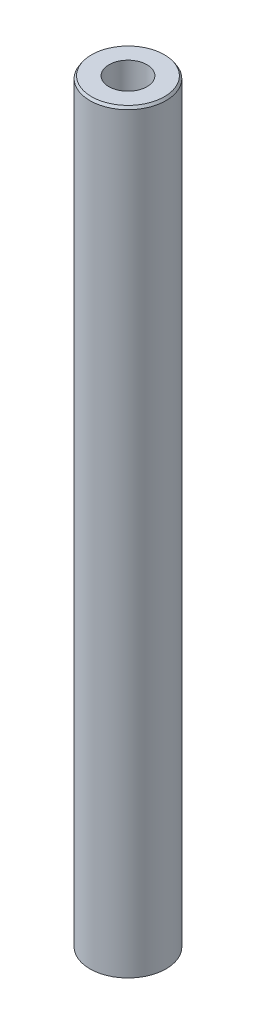
ISO-10303-21;
HEADER;
FILE_DESCRIPTION(('STEP AP214'),'2;1');
FILE_NAME('part.step','',(''),(''),'','','');
FILE_SCHEMA(('AUTOMOTIVE_DESIGN { 1 0 10303 214 1 1 1 1 }'));
ENDSEC;
DATA;
#1=APPLICATION_CONTEXT('core data for automotive mechanical design processes');
#2=APPLICATION_PROTOCOL_DEFINITION('international standard','automotive_design',2000,#1);
#3=PRODUCT_CONTEXT('',#1,'mechanical');
#4=PRODUCT('Part','Part','',(#3));
#5=PRODUCT_RELATED_PRODUCT_CATEGORY('part','',(#4));
#6=PRODUCT_DEFINITION_FORMATION('','',#4);
#7=PRODUCT_DEFINITION_CONTEXT('part definition',#1,'design');
#8=PRODUCT_DEFINITION('design','',#6,#7);
#9=PRODUCT_DEFINITION_SHAPE('','',#8);
#10=(LENGTH_UNIT() NAMED_UNIT(*) SI_UNIT(.MILLI.,.METRE.));
#11=(NAMED_UNIT(*) PLANE_ANGLE_UNIT() SI_UNIT($,.RADIAN.));
#12=(NAMED_UNIT(*) SI_UNIT($,.STERADIAN.) SOLID_ANGLE_UNIT());
#13=UNCERTAINTY_MEASURE_WITH_UNIT(LENGTH_MEASURE(1.E-05),#10,'distance_accuracy_value','');
#14=(GEOMETRIC_REPRESENTATION_CONTEXT(3) GLOBAL_UNCERTAINTY_ASSIGNED_CONTEXT((#13)) GLOBAL_UNIT_ASSIGNED_CONTEXT((#10,
#11,#12)) REPRESENTATION_CONTEXT('',''));
#15=CARTESIAN_POINT('',(0.,0.,0.));
#16=DIRECTION('',(0.,0.,1.));
#17=DIRECTION('',(1.,0.,0.));
#18=AXIS2_PLACEMENT_3D('',#15,#16,#17);
#19=CARTESIAN_POINT('',(0.,248.15361069163,0.));
#20=DIRECTION('',(0.,-1.,0.));
#21=DIRECTION('',(0.,0.,-1.));
#22=AXIS2_PLACEMENT_3D('',#19,#20,#21);
#23=CYLINDRICAL_SURFACE('',#22,12.5);
#24=CARTESIAN_POINT('',(0.,247.324947811233,0.));
#25=DIRECTION('',(0.,1.,0.));
#26=DIRECTION('',(0.,0.,1.));
#27=AXIS2_PLACEMENT_3D('',#24,#25,#26);
#28=CIRCLE('',#27,12.5);
#29=CARTESIAN_POINT('',(0.,247.324947811233,12.5));
#30=VERTEX_POINT('',#29);
#31=EDGE_CURVE('E50',#30,#30,#28,.F.);
#32=ORIENTED_EDGE('',*,*,#31,.T.);
#33=EDGE_LOOP('',(#32));
#34=FACE_BOUND('',#33,.T.);
#35=CARTESIAN_POINT('',(0.,0.560851095767562,0.));
#36=DIRECTION('',(0.,1.,0.));
#37=DIRECTION('',(0.,0.,1.));
#38=AXIS2_PLACEMENT_3D('',#35,#36,#37);
#39=CIRCLE('',#38,12.5);
#40=CARTESIAN_POINT('',(0.,0.560851095767562,12.5));
#41=VERTEX_POINT('',#40);
#42=EDGE_CURVE('E51',#41,#41,#39,.T.);
#43=ORIENTED_EDGE('',*,*,#42,.T.);
#44=EDGE_LOOP('',(#43));
#45=FACE_BOUND('',#44,.T.);
#46=ADVANCED_FACE('F39',(#34,#45),#23,.T.);
#47=CARTESIAN_POINT('',(0.,248.15361069163,0.));
#48=DIRECTION('',(0.,1.,0.));
#49=DIRECTION('',(0.,0.,1.));
#50=AXIS2_PLACEMENT_3D('',#47,#48,#49);
#51=PLANE('',#50);
#52=CARTESIAN_POINT('',(0.,248.15361069163,0.));
#53=DIRECTION('',(0.,1.,0.));
#54=DIRECTION('',(0.,0.,1.));
#55=AXIS2_PLACEMENT_3D('',#52,#53,#54);
#56=CIRCLE('',#55,11.9391489042325);
#57=CARTESIAN_POINT('',(0.,248.15361069163,11.9391489042325));
#58=VERTEX_POINT('',#57);
#59=EDGE_CURVE('E54',#58,#58,#56,.T.);
#60=ORIENTED_EDGE('',*,*,#59,.T.);
#61=EDGE_LOOP('',(#60));
#62=FACE_BOUND('',#61,.T.);
#63=CARTESIAN_POINT('',(0.,248.15361069163,0.));
#64=DIRECTION('',(0.,1.,0.));
#65=DIRECTION('',(0.,0.,1.));
#66=AXIS2_PLACEMENT_3D('',#63,#64,#65);
#67=CIRCLE('',#66,6.24846962294148);
#68=CARTESIAN_POINT('',(0.,248.15361069163,6.24846962294148));
#69=VERTEX_POINT('',#68);
#70=EDGE_CURVE('E58',#69,#69,#67,.T.);
#71=ORIENTED_EDGE('',*,*,#70,.F.);
#72=EDGE_LOOP('',(#71));
#73=FACE_BOUND('',#72,.T.);
#74=ADVANCED_FACE('F69',(#62,#73),#51,.T.);
#75=CARTESIAN_POINT('',(0.,0.,0.));
#76=DIRECTION('',(0.,1.,0.));
#77=DIRECTION('',(0.,0.,1.));
#78=AXIS2_PLACEMENT_3D('',#75,#76,#77);
#79=PLANE('',#78);
#80=CARTESIAN_POINT('',(0.,0.,0.));
#81=DIRECTION('',(0.,1.,0.));
#82=DIRECTION('',(0.,0.,1.));
#83=AXIS2_PLACEMENT_3D('',#80,#81,#82);
#84=CIRCLE('',#83,11.6713371196027);
#85=CARTESIAN_POINT('',(0.,0.,11.6713371196027));
#86=VERTEX_POINT('',#85);
#87=EDGE_CURVE('E10',#86,#86,#84,.F.);
#88=ORIENTED_EDGE('',*,*,#87,.T.);
#89=EDGE_LOOP('',(#88));
#90=FACE_BOUND('',#89,.T.);
#91=CARTESIAN_POINT('',(0.,0.,0.));
#92=DIRECTION('',(0.,1.,0.));
#93=DIRECTION('',(0.,0.,1.));
#94=AXIS2_PLACEMENT_3D('',#91,#92,#93);
#95=CIRCLE('',#94,6.24846962294148);
#96=CARTESIAN_POINT('',(0.,0.,6.24846962294148));
#97=VERTEX_POINT('',#96);
#98=EDGE_CURVE('E63',#97,#97,#95,.T.);
#99=ORIENTED_EDGE('',*,*,#98,.T.);
#100=EDGE_LOOP('',(#99));
#101=FACE_BOUND('',#100,.T.);
#102=ADVANCED_FACE('F75',(#90,#101),#79,.F.);
#103=CARTESIAN_POINT('',(0.,248.15361069163,0.));
#104=DIRECTION('',(0.,-1.,0.));
#105=DIRECTION('',(0.,0.,-1.));
#106=AXIS2_PLACEMENT_3D('',#103,#104,#105);
#107=CYLINDRICAL_SURFACE('',#106,6.24846962294148);
#108=ORIENTED_EDGE('',*,*,#70,.T.);
#109=EDGE_LOOP('',(#108));
#110=FACE_BOUND('',#109,.T.);
#111=ORIENTED_EDGE('',*,*,#98,.F.);
#112=EDGE_LOOP('',(#111));
#113=FACE_BOUND('',#112,.T.);
#114=ADVANCED_FACE('F70',(#110,#113),#107,.F.);
#115=CARTESIAN_POINT('',(0.,248.15361069163,0.));
#116=DIRECTION('',(0.,-1.,0.));
#117=DIRECTION('',(0.,0.,-1.));
#118=AXIS2_PLACEMENT_3D('',#115,#116,#117);
#119=CONICAL_SURFACE('',#118,11.9391489042325,0.594995197009247);
#120=ORIENTED_EDGE('',*,*,#31,.F.);
#121=EDGE_LOOP('',(#120));
#122=FACE_BOUND('',#121,.T.);
#123=ORIENTED_EDGE('',*,*,#59,.F.);
#124=EDGE_LOOP('',(#123));
#125=FACE_BOUND('',#124,.T.);
#126=ADVANCED_FACE('F81',(#122,#125),#119,.T.);
#127=CARTESIAN_POINT('',(0.,0.560851095767562,0.));
#128=DIRECTION('',(0.,1.,0.));
#129=DIRECTION('',(0.,0.,1.));
#130=AXIS2_PLACEMENT_3D('',#127,#128,#129);
#131=CONICAL_SURFACE('',#130,12.5,0.975801129785666);
#132=ORIENTED_EDGE('',*,*,#87,.F.);
#133=EDGE_LOOP('',(#132));
#134=FACE_BOUND('',#133,.T.);
#135=ORIENTED_EDGE('',*,*,#42,.F.);
#136=EDGE_LOOP('',(#135));
#137=FACE_BOUND('',#136,.T.);
#138=ADVANCED_FACE('F45',(#134,#137),#131,.T.);
#139=CLOSED_SHELL('',(#46,#74,#102,#114,#126,#138));
#140=MANIFOLD_SOLID_BREP('B2',#139);
#141=ADVANCED_BREP_SHAPE_REPRESENTATION('',(#18,#140),#14);
#142=SHAPE_DEFINITION_REPRESENTATION(#9,#141);
ENDSEC;
END-ISO-10303-21;
